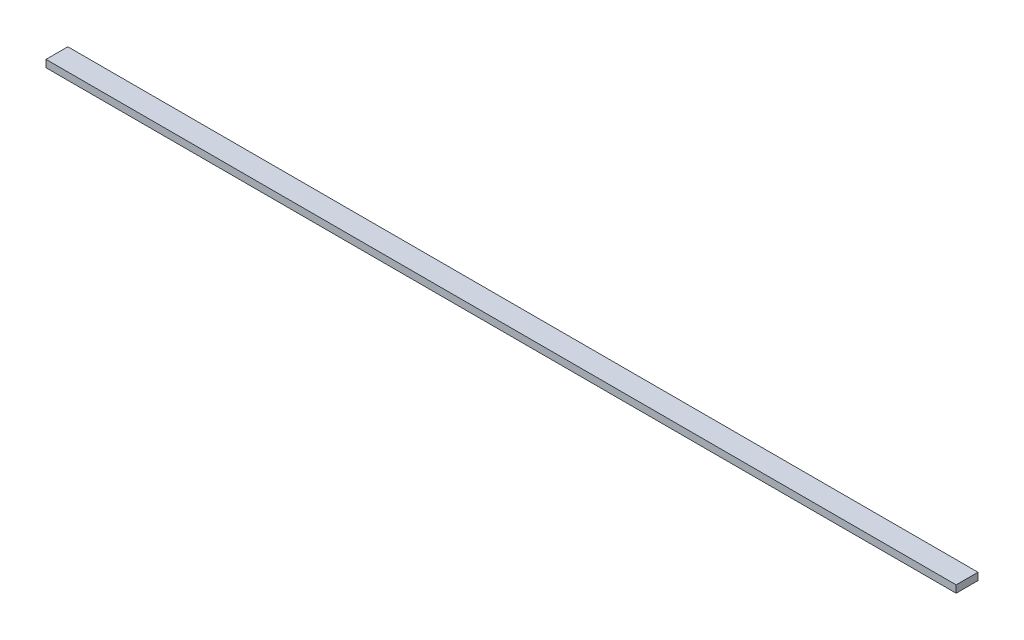
ISO-10303-21;
HEADER;
FILE_DESCRIPTION(('STEP AP214'),'2;1');
FILE_NAME('part.step','',(''),(''),'','','');
FILE_SCHEMA(('AUTOMOTIVE_DESIGN { 1 0 10303 214 1 1 1 1 }'));
ENDSEC;
DATA;
#1=APPLICATION_CONTEXT('core data for automotive mechanical design processes');
#2=APPLICATION_PROTOCOL_DEFINITION('international standard','automotive_design',2000,#1);
#3=PRODUCT_CONTEXT('',#1,'mechanical');
#4=PRODUCT('Part','Part','',(#3));
#5=PRODUCT_RELATED_PRODUCT_CATEGORY('part','',(#4));
#6=PRODUCT_DEFINITION_FORMATION('','',#4);
#7=PRODUCT_DEFINITION_CONTEXT('part definition',#1,'design');
#8=PRODUCT_DEFINITION('design','',#6,#7);
#9=PRODUCT_DEFINITION_SHAPE('','',#8);
#10=(LENGTH_UNIT() NAMED_UNIT(*) SI_UNIT(.MILLI.,.METRE.));
#11=(NAMED_UNIT(*) PLANE_ANGLE_UNIT() SI_UNIT($,.RADIAN.));
#12=(NAMED_UNIT(*) SI_UNIT($,.STERADIAN.) SOLID_ANGLE_UNIT());
#13=UNCERTAINTY_MEASURE_WITH_UNIT(LENGTH_MEASURE(1.E-05),#10,'distance_accuracy_value','');
#14=(GEOMETRIC_REPRESENTATION_CONTEXT(3) GLOBAL_UNCERTAINTY_ASSIGNED_CONTEXT((#13)) GLOBAL_UNIT_ASSIGNED_CONTEXT((#10,
#11,#12)) REPRESENTATION_CONTEXT('',''));
#15=CARTESIAN_POINT('',(0.,0.,0.));
#16=DIRECTION('',(0.,0.,1.));
#17=DIRECTION('',(1.,0.,0.));
#18=AXIS2_PLACEMENT_3D('',#15,#16,#17);
#19=CARTESIAN_POINT('',(-625.,10.,-15.));
#20=DIRECTION('',(1.,0.,0.));
#21=DIRECTION('',(0.,0.,-1.));
#22=AXIS2_PLACEMENT_3D('',#19,#20,#21);
#23=PLANE('',#22);
#24=DIRECTION('',(0.,0.,1.));
#25=VECTOR('',#24,1.);
#26=CARTESIAN_POINT('',(-625.,0.,-15.));
#27=LINE('',#26,#25);
#28=CARTESIAN_POINT('',(-625.,0.,-15.));
#29=VERTEX_POINT('',#28);
#30=CARTESIAN_POINT('',(-625.,0.,15.));
#31=VERTEX_POINT('',#30);
#32=EDGE_CURVE('E97',#29,#31,#27,.T.);
#33=ORIENTED_EDGE('',*,*,#32,.T.);
#34=DIRECTION('',(0.,-1.,0.));
#35=VECTOR('',#34,1.);
#36=CARTESIAN_POINT('',(-625.,10.,15.));
#37=LINE('',#36,#35);
#38=CARTESIAN_POINT('',(-625.,10.,15.));
#39=VERTEX_POINT('',#38);
#40=EDGE_CURVE('E11',#39,#31,#37,.T.);
#41=ORIENTED_EDGE('',*,*,#40,.F.);
#42=DIRECTION('',(0.,0.,1.));
#43=VECTOR('',#42,1.);
#44=CARTESIAN_POINT('',(-625.,10.,-15.));
#45=LINE('',#44,#43);
#46=CARTESIAN_POINT('',(-625.,10.,-15.));
#47=VERTEX_POINT('',#46);
#48=EDGE_CURVE('E85',#47,#39,#45,.T.);
#49=ORIENTED_EDGE('',*,*,#48,.F.);
#50=DIRECTION('',(0.,-1.,0.));
#51=VECTOR('',#50,1.);
#52=CARTESIAN_POINT('',(-625.,10.,-15.));
#53=LINE('',#52,#51);
#54=EDGE_CURVE('E93',#47,#29,#53,.T.);
#55=ORIENTED_EDGE('',*,*,#54,.T.);
#56=EDGE_LOOP('',(#33,#41,#49,#55));
#57=FACE_BOUND('',#56,.T.);
#58=ADVANCED_FACE('F34',(#57),#23,.F.);
#59=CARTESIAN_POINT('',(-625.,10.,15.));
#60=DIRECTION('',(0.,0.,-1.));
#61=DIRECTION('',(-1.,0.,0.));
#62=AXIS2_PLACEMENT_3D('',#59,#60,#61);
#63=PLANE('',#62);
#64=DIRECTION('',(1.,0.,0.));
#65=VECTOR('',#64,1.);
#66=CARTESIAN_POINT('',(-625.,0.,15.));
#67=LINE('',#66,#65);
#68=CARTESIAN_POINT('',(625.,0.,15.));
#69=VERTEX_POINT('',#68);
#70=EDGE_CURVE('E89',#31,#69,#67,.T.);
#71=ORIENTED_EDGE('',*,*,#70,.T.);
#72=DIRECTION('',(0.,-1.,0.));
#73=VECTOR('',#72,1.);
#74=CARTESIAN_POINT('',(625.,10.,15.));
#75=LINE('',#74,#73);
#76=CARTESIAN_POINT('',(625.,10.,15.));
#77=VERTEX_POINT('',#76);
#78=EDGE_CURVE('E42',#77,#69,#75,.T.);
#79=ORIENTED_EDGE('',*,*,#78,.F.);
#80=DIRECTION('',(1.,0.,0.));
#81=VECTOR('',#80,1.);
#82=CARTESIAN_POINT('',(-625.,10.,15.));
#83=LINE('',#82,#81);
#84=EDGE_CURVE('E80',#39,#77,#83,.T.);
#85=ORIENTED_EDGE('',*,*,#84,.F.);
#86=ORIENTED_EDGE('',*,*,#40,.T.);
#87=EDGE_LOOP('',(#71,#79,#85,#86));
#88=FACE_BOUND('',#87,.T.);
#89=ADVANCED_FACE('F88',(#88),#63,.F.);
#90=CARTESIAN_POINT('',(625.,10.,-15.));
#91=DIRECTION('',(-1.,0.,0.));
#92=DIRECTION('',(0.,0.,1.));
#93=AXIS2_PLACEMENT_3D('',#90,#91,#92);
#94=PLANE('',#93);
#95=DIRECTION('',(0.,0.,-1.));
#96=VECTOR('',#95,1.);
#97=CARTESIAN_POINT('',(625.,0.,-15.));
#98=LINE('',#97,#96);
#99=CARTESIAN_POINT('',(625.,0.,-15.));
#100=VERTEX_POINT('',#99);
#101=EDGE_CURVE('E67',#69,#100,#98,.T.);
#102=ORIENTED_EDGE('',*,*,#101,.T.);
#103=DIRECTION('',(0.,-1.,0.));
#104=VECTOR('',#103,1.);
#105=CARTESIAN_POINT('',(625.,10.,-15.));
#106=LINE('',#105,#104);
#107=CARTESIAN_POINT('',(625.,10.,-15.));
#108=VERTEX_POINT('',#107);
#109=EDGE_CURVE('E90',#108,#100,#106,.T.);
#110=ORIENTED_EDGE('',*,*,#109,.F.);
#111=DIRECTION('',(0.,0.,-1.));
#112=VECTOR('',#111,1.);
#113=CARTESIAN_POINT('',(625.,10.,-15.));
#114=LINE('',#113,#112);
#115=EDGE_CURVE('E83',#77,#108,#114,.T.);
#116=ORIENTED_EDGE('',*,*,#115,.F.);
#117=ORIENTED_EDGE('',*,*,#78,.T.);
#118=EDGE_LOOP('',(#102,#110,#116,#117));
#119=FACE_BOUND('',#118,.T.);
#120=ADVANCED_FACE('F91',(#119),#94,.F.);
#121=CARTESIAN_POINT('',(-625.,10.,-15.));
#122=DIRECTION('',(0.,0.,1.));
#123=DIRECTION('',(1.,0.,0.));
#124=AXIS2_PLACEMENT_3D('',#121,#122,#123);
#125=PLANE('',#124);
#126=DIRECTION('',(-1.,0.,0.));
#127=VECTOR('',#126,1.);
#128=CARTESIAN_POINT('',(-625.,0.,-15.));
#129=LINE('',#128,#127);
#130=EDGE_CURVE('E73',#100,#29,#129,.T.);
#131=ORIENTED_EDGE('',*,*,#130,.T.);
#132=ORIENTED_EDGE('',*,*,#54,.F.);
#133=DIRECTION('',(-1.,0.,0.));
#134=VECTOR('',#133,1.);
#135=CARTESIAN_POINT('',(-625.,10.,-15.));
#136=LINE('',#135,#134);
#137=EDGE_CURVE('E50',#108,#47,#136,.T.);
#138=ORIENTED_EDGE('',*,*,#137,.F.);
#139=ORIENTED_EDGE('',*,*,#109,.T.);
#140=EDGE_LOOP('',(#131,#132,#138,#139));
#141=FACE_BOUND('',#140,.T.);
#142=ADVANCED_FACE('F104',(#141),#125,.F.);
#143=CARTESIAN_POINT('',(0.,10.,0.));
#144=DIRECTION('',(0.,1.,0.));
#145=DIRECTION('',(0.,0.,1.));
#146=AXIS2_PLACEMENT_3D('',#143,#144,#145);
#147=PLANE('',#146);
#148=ORIENTED_EDGE('',*,*,#48,.T.);
#149=ORIENTED_EDGE('',*,*,#84,.T.);
#150=ORIENTED_EDGE('',*,*,#115,.T.);
#151=ORIENTED_EDGE('',*,*,#137,.T.);
#152=EDGE_LOOP('',(#148,#149,#150,#151));
#153=FACE_BOUND('',#152,.T.);
#154=ADVANCED_FACE('F81',(#153),#147,.T.);
#155=CARTESIAN_POINT('',(0.,0.,0.));
#156=DIRECTION('',(0.,1.,0.));
#157=DIRECTION('',(0.,0.,1.));
#158=AXIS2_PLACEMENT_3D('',#155,#156,#157);
#159=PLANE('',#158);
#160=ORIENTED_EDGE('',*,*,#32,.F.);
#161=ORIENTED_EDGE('',*,*,#130,.F.);
#162=ORIENTED_EDGE('',*,*,#101,.F.);
#163=ORIENTED_EDGE('',*,*,#70,.F.);
#164=EDGE_LOOP('',(#160,#161,#162,#163));
#165=FACE_BOUND('',#164,.T.);
#166=ADVANCED_FACE('F107',(#165),#159,.F.);
#167=CLOSED_SHELL('',(#58,#89,#120,#142,#154,#166));
#168=MANIFOLD_SOLID_BREP('B2',#167);
#169=ADVANCED_BREP_SHAPE_REPRESENTATION('',(#18,#168),#14);
#170=SHAPE_DEFINITION_REPRESENTATION(#9,#169);
ENDSEC;
END-ISO-10303-21;
